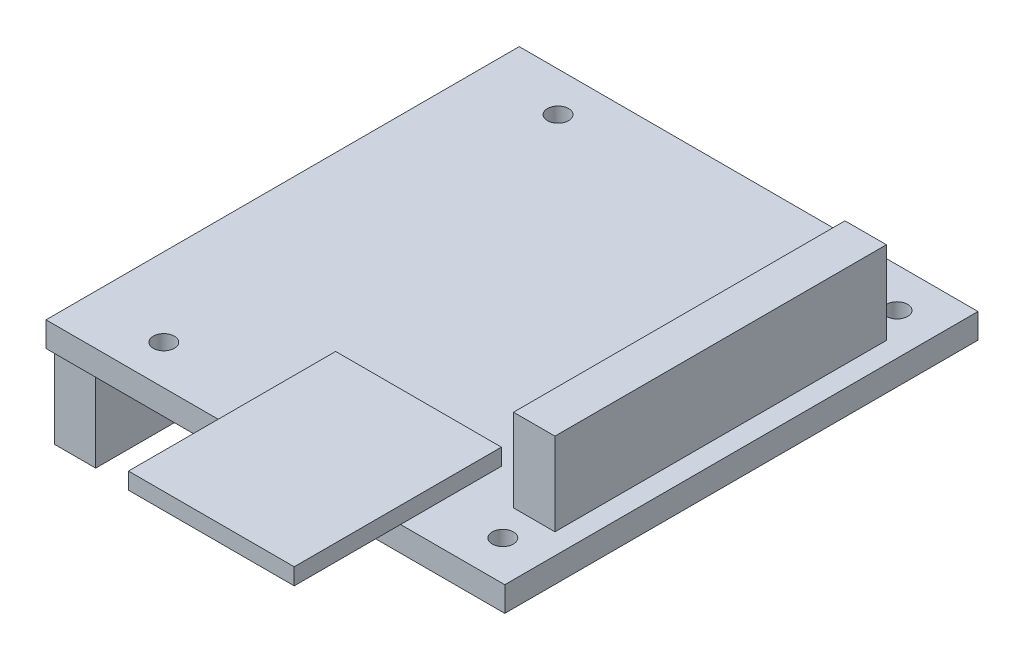
ISO-10303-21;
HEADER;
FILE_DESCRIPTION(('STEP AP214'),'2;1');
FILE_NAME('part.step','',(''),(''),'','','');
FILE_SCHEMA(('AUTOMOTIVE_DESIGN { 1 0 10303 214 1 1 1 1 }'));
ENDSEC;
DATA;
#1=APPLICATION_CONTEXT('core data for automotive mechanical design processes');
#2=APPLICATION_PROTOCOL_DEFINITION('international standard','automotive_design',2000,#1);
#3=PRODUCT_CONTEXT('',#1,'mechanical');
#4=PRODUCT('Part','Part','',(#3));
#5=PRODUCT_RELATED_PRODUCT_CATEGORY('part','',(#4));
#6=PRODUCT_DEFINITION_FORMATION('','',#4);
#7=PRODUCT_DEFINITION_CONTEXT('part definition',#1,'design');
#8=PRODUCT_DEFINITION('design','',#6,#7);
#9=PRODUCT_DEFINITION_SHAPE('','',#8);
#10=(LENGTH_UNIT() NAMED_UNIT(*) SI_UNIT(.MILLI.,.METRE.));
#11=(NAMED_UNIT(*) PLANE_ANGLE_UNIT() SI_UNIT($,.RADIAN.));
#12=(NAMED_UNIT(*) SI_UNIT($,.STERADIAN.) SOLID_ANGLE_UNIT());
#13=UNCERTAINTY_MEASURE_WITH_UNIT(LENGTH_MEASURE(1.E-05),#10,'distance_accuracy_value','');
#14=(GEOMETRIC_REPRESENTATION_CONTEXT(3) GLOBAL_UNCERTAINTY_ASSIGNED_CONTEXT((#13)) GLOBAL_UNIT_ASSIGNED_CONTEXT((#10,
#11,#12)) REPRESENTATION_CONTEXT('',''));
#15=CARTESIAN_POINT('',(0.,0.,0.));
#16=DIRECTION('',(0.,0.,1.));
#17=DIRECTION('',(1.,0.,0.));
#18=AXIS2_PLACEMENT_3D('',#15,#16,#17);
#19=CARTESIAN_POINT('',(0.,0.,-57.1));
#20=DIRECTION('',(0.,-1.,0.));
#21=DIRECTION('',(0.,0.,-1.));
#22=AXIS2_PLACEMENT_3D('',#19,#20,#21);
#23=PLANE('',#22);
#24=DIRECTION('',(1.,0.,0.));
#25=VECTOR('',#24,1.);
#26=CARTESIAN_POINT('',(0.5,0.,-56.6));
#27=LINE('',#26,#25);
#28=CARTESIAN_POINT('',(0.5,0.,-56.6));
#29=VERTEX_POINT('',#28);
#30=CARTESIAN_POINT('',(5.5,0.,-56.6));
#31=VERTEX_POINT('',#30);
#32=EDGE_CURVE('E210',#29,#31,#27,.T.);
#33=ORIENTED_EDGE('',*,*,#32,.F.);
#34=DIRECTION('',(0.,0.,-1.));
#35=VECTOR('',#34,1.);
#36=CARTESIAN_POINT('',(0.5,0.,-56.6));
#37=LINE('',#36,#35);
#38=CARTESIAN_POINT('',(0.5,0.,-0.5));
#39=VERTEX_POINT('',#38);
#40=EDGE_CURVE('E207',#39,#29,#37,.T.);
#41=ORIENTED_EDGE('',*,*,#40,.F.);
#42=DIRECTION('',(-1.,0.,0.));
#43=VECTOR('',#42,1.);
#44=CARTESIAN_POINT('',(0.5,0.,-0.5));
#45=LINE('',#44,#43);
#46=CARTESIAN_POINT('',(5.5,0.,-0.5));
#47=VERTEX_POINT('',#46);
#48=EDGE_CURVE('E220',#47,#39,#45,.T.);
#49=ORIENTED_EDGE('',*,*,#48,.F.);
#50=DIRECTION('',(0.,0.,1.));
#51=VECTOR('',#50,1.);
#52=CARTESIAN_POINT('',(5.5,0.,-56.6));
#53=LINE('',#52,#51);
#54=EDGE_CURVE('E228',#31,#47,#53,.T.);
#55=ORIENTED_EDGE('',*,*,#54,.F.);
#56=EDGE_LOOP('',(#33,#41,#49,#55));
#57=FACE_BOUND('',#56,.T.);
#58=CARTESIAN_POINT('',(9.45000000000002,0.,-4.765));
#59=DIRECTION('',(0.,1.,0.));
#60=DIRECTION('',(0.,0.,1.));
#61=AXIS2_PLACEMENT_3D('',#58,#59,#60);
#62=CIRCLE('',#61,1.275);
#63=CARTESIAN_POINT('',(9.45000000000002,0.,-3.49));
#64=VERTEX_POINT('',#63);
#65=EDGE_CURVE('E310',#64,#64,#62,.T.);
#66=ORIENTED_EDGE('',*,*,#65,.T.);
#67=EDGE_LOOP('',(#66));
#68=FACE_BOUND('',#67,.T.);
#69=CARTESIAN_POINT('',(9.45000000000002,0.,-52.335));
#70=DIRECTION('',(0.,1.,0.));
#71=DIRECTION('',(0.,0.,1.));
#72=AXIS2_PLACEMENT_3D('',#69,#70,#71);
#73=CIRCLE('',#72,1.275);
#74=CARTESIAN_POINT('',(9.45000000000002,0.,-51.06));
#75=VERTEX_POINT('',#74);
#76=EDGE_CURVE('E322',#75,#75,#73,.T.);
#77=ORIENTED_EDGE('',*,*,#76,.T.);
#78=EDGE_LOOP('',(#77));
#79=FACE_BOUND('',#78,.T.);
#80=CARTESIAN_POINT('',(50.36,0.,-52.335));
#81=DIRECTION('',(0.,1.,0.));
#82=DIRECTION('',(0.,0.,1.));
#83=AXIS2_PLACEMENT_3D('',#80,#81,#82);
#84=CIRCLE('',#83,1.275);
#85=CARTESIAN_POINT('',(50.36,0.,-51.06));
#86=VERTEX_POINT('',#85);
#87=EDGE_CURVE('E316',#86,#86,#84,.T.);
#88=ORIENTED_EDGE('',*,*,#87,.T.);
#89=EDGE_LOOP('',(#88));
#90=FACE_BOUND('',#89,.T.);
#91=CARTESIAN_POINT('',(50.36,0.,-4.765));
#92=DIRECTION('',(0.,1.,0.));
#93=DIRECTION('',(0.,0.,1.));
#94=AXIS2_PLACEMENT_3D('',#91,#92,#93);
#95=CIRCLE('',#94,1.275);
#96=CARTESIAN_POINT('',(50.36,0.,-3.49));
#97=VERTEX_POINT('',#96);
#98=EDGE_CURVE('E306',#97,#97,#95,.T.);
#99=ORIENTED_EDGE('',*,*,#98,.T.);
#100=EDGE_LOOP('',(#99));
#101=FACE_BOUND('',#100,.T.);
#102=DIRECTION('',(-1.,0.,0.));
#103=VECTOR('',#102,1.);
#104=CARTESIAN_POINT('',(22.2441503540784,0.,-54.9329702264743));
#105=LINE('',#104,#103);
#106=CARTESIAN_POINT('',(22.2441503540784,0.,-54.9329702264743));
#107=VERTEX_POINT('',#106);
#108=CARTESIAN_POINT('',(12.2441503540784,0.,-54.9329702264743));
#109=VERTEX_POINT('',#108);
#110=EDGE_CURVE('E439',#107,#109,#105,.T.);
#111=ORIENTED_EDGE('',*,*,#110,.F.);
#112=DIRECTION('',(0.,0.,1.));
#113=VECTOR('',#112,1.);
#114=CARTESIAN_POINT('',(22.2441503540784,0.,-54.9329702264743));
#115=LINE('',#114,#113);
#116=CARTESIAN_POINT('',(22.2441503540784,0.,-57.1));
#117=VERTEX_POINT('',#116);
#118=EDGE_CURVE('E206',#117,#107,#115,.T.);
#119=ORIENTED_EDGE('',*,*,#118,.F.);
#120=DIRECTION('',(-1.,0.,0.));
#121=VECTOR('',#120,1.);
#122=CARTESIAN_POINT('',(0.,0.,-57.1));
#123=LINE('',#122,#121);
#124=CARTESIAN_POINT('',(55.36,0.,-57.1));
#125=VERTEX_POINT('',#124);
#126=EDGE_CURVE('E335',#125,#117,#123,.T.);
#127=ORIENTED_EDGE('',*,*,#126,.F.);
#128=DIRECTION('',(0.,0.,-1.));
#129=VECTOR('',#128,1.);
#130=CARTESIAN_POINT('',(55.36,0.,0.));
#131=LINE('',#130,#129);
#132=CARTESIAN_POINT('',(55.36,0.,0.));
#133=VERTEX_POINT('',#132);
#134=EDGE_CURVE('E349',#133,#125,#131,.T.);
#135=ORIENTED_EDGE('',*,*,#134,.F.);
#136=DIRECTION('',(1.,0.,0.));
#137=VECTOR('',#136,1.);
#138=CARTESIAN_POINT('',(0.,0.,0.));
#139=LINE('',#138,#137);
#140=CARTESIAN_POINT('',(0.,0.,0.));
#141=VERTEX_POINT('',#140);
#142=EDGE_CURVE('E347',#141,#133,#139,.T.);
#143=ORIENTED_EDGE('',*,*,#142,.F.);
#144=DIRECTION('',(0.,0.,1.));
#145=VECTOR('',#144,1.);
#146=CARTESIAN_POINT('',(0.,0.,0.));
#147=LINE('',#146,#145);
#148=CARTESIAN_POINT('',(0.,0.,-57.1));
#149=VERTEX_POINT('',#148);
#150=EDGE_CURVE('E328',#149,#141,#147,.T.);
#151=ORIENTED_EDGE('',*,*,#150,.F.);
#152=CARTESIAN_POINT('',(12.2441503540784,0.,-57.1));
#153=VERTEX_POINT('',#152);
#154=EDGE_CURVE('E351',#153,#149,#123,.T.);
#155=ORIENTED_EDGE('',*,*,#154,.F.);
#156=DIRECTION('',(0.,0.,-1.));
#157=VECTOR('',#156,1.);
#158=CARTESIAN_POINT('',(12.2441503540784,0.,-54.9329702264743));
#159=LINE('',#158,#157);
#160=EDGE_CURVE('E46',#109,#153,#159,.T.);
#161=ORIENTED_EDGE('',*,*,#160,.F.);
#162=EDGE_LOOP('',(#111,#119,#127,#135,#143,#151,#155,#161));
#163=FACE_BOUND('',#162,.T.);
#164=ADVANCED_FACE('F31',(#57,#68,#79,#90,#101,#163),#23,.T.);
#165=CARTESIAN_POINT('',(0.,3.,-57.1));
#166=DIRECTION('',(0.,-1.,0.));
#167=DIRECTION('',(0.,0.,-1.));
#168=AXIS2_PLACEMENT_3D('',#165,#166,#167);
#169=PLANE('',#168);
#170=DIRECTION('',(0.,0.,1.));
#171=VECTOR('',#170,1.);
#172=CARTESIAN_POINT('',(47.86,3.,-48.55));
#173=LINE('',#172,#171);
#174=CARTESIAN_POINT('',(47.86,3.,-48.55));
#175=VERTEX_POINT('',#174);
#176=CARTESIAN_POINT('',(47.86,3.,-8.55));
#177=VERTEX_POINT('',#176);
#178=EDGE_CURVE('E273',#175,#177,#173,.T.);
#179=ORIENTED_EDGE('',*,*,#178,.F.);
#180=DIRECTION('',(-1.,0.,0.));
#181=VECTOR('',#180,1.);
#182=CARTESIAN_POINT('',(47.86,3.,-48.55));
#183=LINE('',#182,#181);
#184=CARTESIAN_POINT('',(52.86,3.,-48.55));
#185=VERTEX_POINT('',#184);
#186=EDGE_CURVE('E278',#185,#175,#183,.T.);
#187=ORIENTED_EDGE('',*,*,#186,.F.);
#188=DIRECTION('',(0.,0.,-1.));
#189=VECTOR('',#188,1.);
#190=CARTESIAN_POINT('',(52.86,3.,-48.55));
#191=LINE('',#190,#189);
#192=CARTESIAN_POINT('',(52.86,3.,-8.55));
#193=VERTEX_POINT('',#192);
#194=EDGE_CURVE('E290',#193,#185,#191,.T.);
#195=ORIENTED_EDGE('',*,*,#194,.F.);
#196=DIRECTION('',(1.,0.,0.));
#197=VECTOR('',#196,1.);
#198=CARTESIAN_POINT('',(47.86,3.,-8.55));
#199=LINE('',#198,#197);
#200=EDGE_CURVE('E287',#177,#193,#199,.T.);
#201=ORIENTED_EDGE('',*,*,#200,.F.);
#202=EDGE_LOOP('',(#179,#187,#195,#201));
#203=FACE_BOUND('',#202,.T.);
#204=CARTESIAN_POINT('',(9.45000000000002,3.,-4.765));
#205=DIRECTION('',(0.,1.,0.));
#206=DIRECTION('',(0.,0.,1.));
#207=AXIS2_PLACEMENT_3D('',#204,#205,#206);
#208=CIRCLE('',#207,1.275);
#209=CARTESIAN_POINT('',(9.45000000000002,3.,-3.49));
#210=VERTEX_POINT('',#209);
#211=EDGE_CURVE('E313',#210,#210,#208,.T.);
#212=ORIENTED_EDGE('',*,*,#211,.F.);
#213=EDGE_LOOP('',(#212));
#214=FACE_BOUND('',#213,.T.);
#215=CARTESIAN_POINT('',(9.45000000000002,3.,-52.335));
#216=DIRECTION('',(0.,1.,0.));
#217=DIRECTION('',(0.,0.,1.));
#218=AXIS2_PLACEMENT_3D('',#215,#216,#217);
#219=CIRCLE('',#218,1.275);
#220=CARTESIAN_POINT('',(9.45000000000002,3.,-51.06));
#221=VERTEX_POINT('',#220);
#222=EDGE_CURVE('E325',#221,#221,#219,.T.);
#223=ORIENTED_EDGE('',*,*,#222,.F.);
#224=EDGE_LOOP('',(#223));
#225=FACE_BOUND('',#224,.T.);
#226=CARTESIAN_POINT('',(50.36,3.,-52.335));
#227=DIRECTION('',(0.,1.,0.));
#228=DIRECTION('',(0.,0.,1.));
#229=AXIS2_PLACEMENT_3D('',#226,#227,#228);
#230=CIRCLE('',#229,1.275);
#231=CARTESIAN_POINT('',(50.36,3.,-51.06));
#232=VERTEX_POINT('',#231);
#233=EDGE_CURVE('E319',#232,#232,#230,.T.);
#234=ORIENTED_EDGE('',*,*,#233,.F.);
#235=EDGE_LOOP('',(#234));
#236=FACE_BOUND('',#235,.T.);
#237=CARTESIAN_POINT('',(50.36,3.,-4.765));
#238=DIRECTION('',(0.,1.,0.));
#239=DIRECTION('',(0.,0.,1.));
#240=AXIS2_PLACEMENT_3D('',#237,#238,#239);
#241=CIRCLE('',#240,1.275);
#242=CARTESIAN_POINT('',(50.36,3.,-3.49));
#243=VERTEX_POINT('',#242);
#244=EDGE_CURVE('E307',#243,#243,#241,.T.);
#245=ORIENTED_EDGE('',*,*,#244,.F.);
#246=EDGE_LOOP('',(#245));
#247=FACE_BOUND('',#246,.T.);
#248=DIRECTION('',(0.,0.,-1.));
#249=VECTOR('',#248,1.);
#250=CARTESIAN_POINT('',(42.7802768204413,3.,-12.1695950704833));
#251=LINE('',#250,#249);
#252=CARTESIAN_POINT('',(42.7802768204413,3.,0.));
#253=VERTEX_POINT('',#252);
#254=CARTESIAN_POINT('',(42.7802768204413,3.,-12.1695950704833));
#255=VERTEX_POINT('',#254);
#256=EDGE_CURVE('E239',#253,#255,#251,.T.);
#257=ORIENTED_EDGE('',*,*,#256,.F.);
#258=DIRECTION('',(1.,0.,0.));
#259=VECTOR('',#258,1.);
#260=CARTESIAN_POINT('',(0.,3.,0.));
#261=LINE('',#260,#259);
#262=CARTESIAN_POINT('',(55.36,3.,0.));
#263=VERTEX_POINT('',#262);
#264=EDGE_CURVE('E334',#253,#263,#261,.T.);
#265=ORIENTED_EDGE('',*,*,#264,.T.);
#266=DIRECTION('',(0.,0.,-1.));
#267=VECTOR('',#266,1.);
#268=CARTESIAN_POINT('',(55.36,3.,0.));
#269=LINE('',#268,#267);
#270=CARTESIAN_POINT('',(55.36,3.,-57.1));
#271=VERTEX_POINT('',#270);
#272=EDGE_CURVE('E339',#263,#271,#269,.T.);
#273=ORIENTED_EDGE('',*,*,#272,.T.);
#274=DIRECTION('',(-1.,0.,0.));
#275=VECTOR('',#274,1.);
#276=CARTESIAN_POINT('',(0.,3.,-57.1));
#277=LINE('',#276,#275);
#278=CARTESIAN_POINT('',(0.,3.,-57.1));
#279=VERTEX_POINT('',#278);
#280=EDGE_CURVE('E342',#271,#279,#277,.T.);
#281=ORIENTED_EDGE('',*,*,#280,.T.);
#282=DIRECTION('',(0.,0.,1.));
#283=VECTOR('',#282,1.);
#284=CARTESIAN_POINT('',(0.,3.,0.));
#285=LINE('',#284,#283);
#286=CARTESIAN_POINT('',(0.,3.,0.));
#287=VERTEX_POINT('',#286);
#288=EDGE_CURVE('E331',#279,#287,#285,.T.);
#289=ORIENTED_EDGE('',*,*,#288,.T.);
#290=CARTESIAN_POINT('',(22.7802768204413,3.,0.));
#291=VERTEX_POINT('',#290);
#292=EDGE_CURVE('E336',#287,#291,#261,.T.);
#293=ORIENTED_EDGE('',*,*,#292,.T.);
#294=DIRECTION('',(0.,0.,1.));
#295=VECTOR('',#294,1.);
#296=CARTESIAN_POINT('',(22.7802768204413,3.,-12.1695950704833));
#297=LINE('',#296,#295);
#298=CARTESIAN_POINT('',(22.7802768204413,3.,-12.1695950704833));
#299=VERTEX_POINT('',#298);
#300=EDGE_CURVE('E258',#299,#291,#297,.T.);
#301=ORIENTED_EDGE('',*,*,#300,.F.);
#302=DIRECTION('',(-1.,0.,0.));
#303=VECTOR('',#302,1.);
#304=CARTESIAN_POINT('',(42.7802768204413,3.,-12.1695950704833));
#305=LINE('',#304,#303);
#306=EDGE_CURVE('E254',#255,#299,#305,.T.);
#307=ORIENTED_EDGE('',*,*,#306,.F.);
#308=EDGE_LOOP('',(#257,#265,#273,#281,#289,#293,#301,#307));
#309=FACE_BOUND('',#308,.T.);
#310=ADVANCED_FACE('F378',(#203,#214,#225,#236,#247,#309),#169,.F.);
#311=CARTESIAN_POINT('',(0.,3.,0.));
#312=DIRECTION('',(1.,0.,0.));
#313=DIRECTION('',(0.,0.,-1.));
#314=AXIS2_PLACEMENT_3D('',#311,#312,#313);
#315=PLANE('',#314);
#316=ORIENTED_EDGE('',*,*,#150,.T.);
#317=DIRECTION('',(0.,-1.,0.));
#318=VECTOR('',#317,1.);
#319=CARTESIAN_POINT('',(0.,3.,0.));
#320=LINE('',#319,#318);
#321=EDGE_CURVE('E11',#287,#141,#320,.T.);
#322=ORIENTED_EDGE('',*,*,#321,.F.);
#323=ORIENTED_EDGE('',*,*,#288,.F.);
#324=DIRECTION('',(0.,-1.,0.));
#325=VECTOR('',#324,1.);
#326=CARTESIAN_POINT('',(0.,3.,-57.1));
#327=LINE('',#326,#325);
#328=EDGE_CURVE('E344',#279,#149,#327,.T.);
#329=ORIENTED_EDGE('',*,*,#328,.T.);
#330=EDGE_LOOP('',(#316,#322,#323,#329));
#331=FACE_BOUND('',#330,.T.);
#332=ADVANCED_FACE('F33',(#331),#315,.F.);
#333=CARTESIAN_POINT('',(0.,3.,0.));
#334=DIRECTION('',(0.,0.,-1.));
#335=DIRECTION('',(-1.,0.,0.));
#336=AXIS2_PLACEMENT_3D('',#333,#334,#335);
#337=PLANE('',#336);
#338=ORIENTED_EDGE('',*,*,#142,.T.);
#339=DIRECTION('',(0.,-1.,0.));
#340=VECTOR('',#339,1.);
#341=CARTESIAN_POINT('',(55.36,3.,0.));
#342=LINE('',#341,#340);
#343=EDGE_CURVE('E39',#263,#133,#342,.T.);
#344=ORIENTED_EDGE('',*,*,#343,.F.);
#345=ORIENTED_EDGE('',*,*,#264,.F.);
#346=EDGE_CURVE('E340',#291,#253,#261,.T.);
#347=ORIENTED_EDGE('',*,*,#346,.F.);
#348=ORIENTED_EDGE('',*,*,#292,.F.);
#349=ORIENTED_EDGE('',*,*,#321,.T.);
#350=EDGE_LOOP('',(#338,#344,#345,#347,#348,#349));
#351=FACE_BOUND('',#350,.T.);
#352=ADVANCED_FACE('F432',(#351),#337,.F.);
#353=CARTESIAN_POINT('',(55.36,3.,0.));
#354=DIRECTION('',(-1.,0.,0.));
#355=DIRECTION('',(0.,0.,1.));
#356=AXIS2_PLACEMENT_3D('',#353,#354,#355);
#357=PLANE('',#356);
#358=ORIENTED_EDGE('',*,*,#134,.T.);
#359=DIRECTION('',(0.,-1.,0.));
#360=VECTOR('',#359,1.);
#361=CARTESIAN_POINT('',(55.36,3.,-57.1));
#362=LINE('',#361,#360);
#363=EDGE_CURVE('E357',#271,#125,#362,.T.);
#364=ORIENTED_EDGE('',*,*,#363,.F.);
#365=ORIENTED_EDGE('',*,*,#272,.F.);
#366=ORIENTED_EDGE('',*,*,#343,.T.);
#367=EDGE_LOOP('',(#358,#364,#365,#366));
#368=FACE_BOUND('',#367,.T.);
#369=ADVANCED_FACE('F364',(#368),#357,.F.);
#370=CARTESIAN_POINT('',(0.,3.,-57.1));
#371=DIRECTION('',(0.,0.,1.));
#372=DIRECTION('',(1.,0.,0.));
#373=AXIS2_PLACEMENT_3D('',#370,#371,#372);
#374=PLANE('',#373);
#375=ORIENTED_EDGE('',*,*,#126,.T.);
#376=EDGE_CURVE('E354',#117,#153,#123,.T.);
#377=ORIENTED_EDGE('',*,*,#376,.T.);
#378=ORIENTED_EDGE('',*,*,#154,.T.);
#379=ORIENTED_EDGE('',*,*,#328,.F.);
#380=ORIENTED_EDGE('',*,*,#280,.F.);
#381=ORIENTED_EDGE('',*,*,#363,.T.);
#382=EDGE_LOOP('',(#375,#377,#378,#379,#380,#381));
#383=FACE_BOUND('',#382,.T.);
#384=ADVANCED_FACE('F372',(#383),#374,.F.);
#385=CARTESIAN_POINT('',(9.45000000000002,3.,-52.335));
#386=DIRECTION('',(0.,-1.,0.));
#387=DIRECTION('',(0.,0.,-1.));
#388=AXIS2_PLACEMENT_3D('',#385,#386,#387);
#389=CYLINDRICAL_SURFACE('',#388,1.275);
#390=ORIENTED_EDGE('',*,*,#222,.T.);
#391=EDGE_LOOP('',(#390));
#392=FACE_BOUND('',#391,.T.);
#393=ORIENTED_EDGE('',*,*,#76,.F.);
#394=EDGE_LOOP('',(#393));
#395=FACE_BOUND('',#394,.T.);
#396=ADVANCED_FACE('F430',(#392,#395),#389,.F.);
#397=CARTESIAN_POINT('',(50.36,3.,-52.335));
#398=DIRECTION('',(0.,-1.,0.));
#399=DIRECTION('',(0.,0.,-1.));
#400=AXIS2_PLACEMENT_3D('',#397,#398,#399);
#401=CYLINDRICAL_SURFACE('',#400,1.275);
#402=ORIENTED_EDGE('',*,*,#233,.T.);
#403=EDGE_LOOP('',(#402));
#404=FACE_BOUND('',#403,.T.);
#405=ORIENTED_EDGE('',*,*,#87,.F.);
#406=EDGE_LOOP('',(#405));
#407=FACE_BOUND('',#406,.T.);
#408=ADVANCED_FACE('F666',(#404,#407),#401,.F.);
#409=CARTESIAN_POINT('',(9.45000000000002,3.,-4.765));
#410=DIRECTION('',(0.,-1.,0.));
#411=DIRECTION('',(0.,0.,-1.));
#412=AXIS2_PLACEMENT_3D('',#409,#410,#411);
#413=CYLINDRICAL_SURFACE('',#412,1.275);
#414=ORIENTED_EDGE('',*,*,#211,.T.);
#415=EDGE_LOOP('',(#414));
#416=FACE_BOUND('',#415,.T.);
#417=ORIENTED_EDGE('',*,*,#65,.F.);
#418=EDGE_LOOP('',(#417));
#419=FACE_BOUND('',#418,.T.);
#420=ADVANCED_FACE('F657',(#416,#419),#413,.F.);
#421=CARTESIAN_POINT('',(50.36,3.,-4.765));
#422=DIRECTION('',(0.,-1.,0.));
#423=DIRECTION('',(0.,0.,-1.));
#424=AXIS2_PLACEMENT_3D('',#421,#422,#423);
#425=CYLINDRICAL_SURFACE('',#424,1.275);
#426=ORIENTED_EDGE('',*,*,#244,.T.);
#427=EDGE_LOOP('',(#426));
#428=FACE_BOUND('',#427,.T.);
#429=ORIENTED_EDGE('',*,*,#98,.F.);
#430=EDGE_LOOP('',(#429));
#431=FACE_BOUND('',#430,.T.);
#432=ADVANCED_FACE('F648',(#428,#431),#425,.F.);
#433=CARTESIAN_POINT('',(47.86,13.,-48.55));
#434=DIRECTION('',(1.,0.,0.));
#435=DIRECTION('',(0.,0.,-1.));
#436=AXIS2_PLACEMENT_3D('',#433,#434,#435);
#437=PLANE('',#436);
#438=ORIENTED_EDGE('',*,*,#178,.T.);
#439=DIRECTION('',(0.,-1.,0.));
#440=VECTOR('',#439,1.);
#441=CARTESIAN_POINT('',(47.86,13.,-8.55));
#442=LINE('',#441,#440);
#443=CARTESIAN_POINT('',(47.86,13.,-8.55));
#444=VERTEX_POINT('',#443);
#445=EDGE_CURVE('E303',#444,#177,#442,.T.);
#446=ORIENTED_EDGE('',*,*,#445,.F.);
#447=DIRECTION('',(0.,0.,1.));
#448=VECTOR('',#447,1.);
#449=CARTESIAN_POINT('',(47.86,13.,-48.55));
#450=LINE('',#449,#448);
#451=CARTESIAN_POINT('',(47.86,13.,-48.55));
#452=VERTEX_POINT('',#451);
#453=EDGE_CURVE('E274',#452,#444,#450,.T.);
#454=ORIENTED_EDGE('',*,*,#453,.F.);
#455=DIRECTION('',(0.,-1.,0.));
#456=VECTOR('',#455,1.);
#457=CARTESIAN_POINT('',(47.86,13.,-48.55));
#458=LINE('',#457,#456);
#459=EDGE_CURVE('E284',#452,#175,#458,.T.);
#460=ORIENTED_EDGE('',*,*,#459,.T.);
#461=EDGE_LOOP('',(#438,#446,#454,#460));
#462=FACE_BOUND('',#461,.T.);
#463=ADVANCED_FACE('F639',(#462),#437,.F.);
#464=CARTESIAN_POINT('',(47.86,13.,-8.55));
#465=DIRECTION('',(0.,0.,-1.));
#466=DIRECTION('',(-1.,0.,0.));
#467=AXIS2_PLACEMENT_3D('',#464,#465,#466);
#468=PLANE('',#467);
#469=ORIENTED_EDGE('',*,*,#200,.T.);
#470=DIRECTION('',(0.,-1.,0.));
#471=VECTOR('',#470,1.);
#472=CARTESIAN_POINT('',(52.86,13.,-8.55));
#473=LINE('',#472,#471);
#474=CARTESIAN_POINT('',(52.86,13.,-8.55));
#475=VERTEX_POINT('',#474);
#476=EDGE_CURVE('E300',#475,#193,#473,.T.);
#477=ORIENTED_EDGE('',*,*,#476,.F.);
#478=DIRECTION('',(1.,0.,0.));
#479=VECTOR('',#478,1.);
#480=CARTESIAN_POINT('',(47.86,13.,-8.55));
#481=LINE('',#480,#479);
#482=EDGE_CURVE('E277',#444,#475,#481,.T.);
#483=ORIENTED_EDGE('',*,*,#482,.F.);
#484=ORIENTED_EDGE('',*,*,#445,.T.);
#485=EDGE_LOOP('',(#469,#477,#483,#484));
#486=FACE_BOUND('',#485,.T.);
#487=ADVANCED_FACE('F630',(#486),#468,.F.);
#488=CARTESIAN_POINT('',(52.86,13.,-48.55));
#489=DIRECTION('',(-1.,0.,0.));
#490=DIRECTION('',(0.,0.,1.));
#491=AXIS2_PLACEMENT_3D('',#488,#489,#490);
#492=PLANE('',#491);
#493=ORIENTED_EDGE('',*,*,#194,.T.);
#494=DIRECTION('',(0.,-1.,0.));
#495=VECTOR('',#494,1.);
#496=CARTESIAN_POINT('',(52.86,13.,-48.55));
#497=LINE('',#496,#495);
#498=CARTESIAN_POINT('',(52.86,13.,-48.55));
#499=VERTEX_POINT('',#498);
#500=EDGE_CURVE('E297',#499,#185,#497,.T.);
#501=ORIENTED_EDGE('',*,*,#500,.F.);
#502=DIRECTION('',(0.,0.,-1.));
#503=VECTOR('',#502,1.);
#504=CARTESIAN_POINT('',(52.86,13.,-48.55));
#505=LINE('',#504,#503);
#506=EDGE_CURVE('E280',#475,#499,#505,.T.);
#507=ORIENTED_EDGE('',*,*,#506,.F.);
#508=ORIENTED_EDGE('',*,*,#476,.T.);
#509=EDGE_LOOP('',(#493,#501,#507,#508));
#510=FACE_BOUND('',#509,.T.);
#511=ADVANCED_FACE('F621',(#510),#492,.F.);
#512=CARTESIAN_POINT('',(47.86,13.,-48.55));
#513=DIRECTION('',(0.,0.,1.));
#514=DIRECTION('',(1.,0.,0.));
#515=AXIS2_PLACEMENT_3D('',#512,#513,#514);
#516=PLANE('',#515);
#517=ORIENTED_EDGE('',*,*,#186,.T.);
#518=ORIENTED_EDGE('',*,*,#459,.F.);
#519=DIRECTION('',(-1.,0.,0.));
#520=VECTOR('',#519,1.);
#521=CARTESIAN_POINT('',(47.86,13.,-48.55));
#522=LINE('',#521,#520);
#523=EDGE_CURVE('E282',#499,#452,#522,.T.);
#524=ORIENTED_EDGE('',*,*,#523,.F.);
#525=ORIENTED_EDGE('',*,*,#500,.T.);
#526=EDGE_LOOP('',(#517,#518,#524,#525));
#527=FACE_BOUND('',#526,.T.);
#528=ADVANCED_FACE('F612',(#527),#516,.F.);
#529=CARTESIAN_POINT('',(47.86,13.,-8.55));
#530=DIRECTION('',(0.,1.,0.));
#531=DIRECTION('',(0.,0.,1.));
#532=AXIS2_PLACEMENT_3D('',#529,#530,#531);
#533=PLANE('',#532);
#534=ORIENTED_EDGE('',*,*,#453,.T.);
#535=ORIENTED_EDGE('',*,*,#482,.T.);
#536=ORIENTED_EDGE('',*,*,#506,.T.);
#537=ORIENTED_EDGE('',*,*,#523,.T.);
#538=EDGE_LOOP('',(#534,#535,#536,#537));
#539=FACE_BOUND('',#538,.T.);
#540=ADVANCED_FACE('F600',(#539),#533,.T.);
#541=CARTESIAN_POINT('',(42.7802768204413,3.,12.8304049295167));
#542=DIRECTION('',(0.,-1.,0.));
#543=DIRECTION('',(0.,0.,-1.));
#544=AXIS2_PLACEMENT_3D('',#541,#542,#543);
#545=PLANE('',#544);
#546=ORIENTED_EDGE('',*,*,#346,.T.);
#547=CARTESIAN_POINT('',(42.7802768204413,3.,12.8304049295167));
#548=VERTEX_POINT('',#547);
#549=EDGE_CURVE('E251',#548,#253,#251,.T.);
#550=ORIENTED_EDGE('',*,*,#549,.F.);
#551=DIRECTION('',(1.,0.,0.));
#552=VECTOR('',#551,1.);
#553=CARTESIAN_POINT('',(42.7802768204413,3.,12.8304049295167));
#554=LINE('',#553,#552);
#555=CARTESIAN_POINT('',(22.7802768204413,3.,12.8304049295167));
#556=VERTEX_POINT('',#555);
#557=EDGE_CURVE('E244',#556,#548,#554,.T.);
#558=ORIENTED_EDGE('',*,*,#557,.F.);
#559=EDGE_CURVE('E257',#291,#556,#297,.T.);
#560=ORIENTED_EDGE('',*,*,#559,.F.);
#561=EDGE_LOOP('',(#546,#550,#558,#560));
#562=FACE_BOUND('',#561,.T.);
#563=ADVANCED_FACE('F385',(#562),#545,.T.);
#564=CARTESIAN_POINT('',(42.7802768204413,5.,-12.1695950704833));
#565=DIRECTION('',(-1.,0.,0.));
#566=DIRECTION('',(0.,0.,1.));
#567=AXIS2_PLACEMENT_3D('',#564,#565,#566);
#568=PLANE('',#567);
#569=ORIENTED_EDGE('',*,*,#549,.T.);
#570=ORIENTED_EDGE('',*,*,#256,.T.);
#571=DIRECTION('',(0.,-1.,0.));
#572=VECTOR('',#571,1.);
#573=CARTESIAN_POINT('',(42.7802768204413,5.,-12.1695950704833));
#574=LINE('',#573,#572);
#575=CARTESIAN_POINT('',(42.7802768204413,5.,-12.1695950704833));
#576=VERTEX_POINT('',#575);
#577=EDGE_CURVE('E270',#576,#255,#574,.T.);
#578=ORIENTED_EDGE('',*,*,#577,.F.);
#579=DIRECTION('',(0.,0.,-1.));
#580=VECTOR('',#579,1.);
#581=CARTESIAN_POINT('',(42.7802768204413,5.,-12.1695950704833));
#582=LINE('',#581,#580);
#583=CARTESIAN_POINT('',(42.7802768204413,5.,12.8304049295167));
#584=VERTEX_POINT('',#583);
#585=EDGE_CURVE('E240',#584,#576,#582,.T.);
#586=ORIENTED_EDGE('',*,*,#585,.F.);
#587=DIRECTION('',(0.,-1.,0.));
#588=VECTOR('',#587,1.);
#589=CARTESIAN_POINT('',(42.7802768204413,5.,12.8304049295167));
#590=LINE('',#589,#588);
#591=EDGE_CURVE('E250',#584,#548,#590,.T.);
#592=ORIENTED_EDGE('',*,*,#591,.T.);
#593=EDGE_LOOP('',(#569,#570,#578,#586,#592));
#594=FACE_BOUND('',#593,.T.);
#595=ADVANCED_FACE('F388',(#594),#568,.F.);
#596=CARTESIAN_POINT('',(42.7802768204413,5.,-12.1695950704833));
#597=DIRECTION('',(0.,0.,1.));
#598=DIRECTION('',(1.,0.,0.));
#599=AXIS2_PLACEMENT_3D('',#596,#597,#598);
#600=PLANE('',#599);
#601=ORIENTED_EDGE('',*,*,#306,.T.);
#602=DIRECTION('',(0.,-1.,0.));
#603=VECTOR('',#602,1.);
#604=CARTESIAN_POINT('',(22.7802768204413,5.,-12.1695950704833));
#605=LINE('',#604,#603);
#606=CARTESIAN_POINT('',(22.7802768204413,5.,-12.1695950704833));
#607=VERTEX_POINT('',#606);
#608=EDGE_CURVE('E267',#607,#299,#605,.T.);
#609=ORIENTED_EDGE('',*,*,#608,.F.);
#610=DIRECTION('',(-1.,0.,0.));
#611=VECTOR('',#610,1.);
#612=CARTESIAN_POINT('',(42.7802768204413,5.,-12.1695950704833));
#613=LINE('',#612,#611);
#614=EDGE_CURVE('E243',#576,#607,#613,.T.);
#615=ORIENTED_EDGE('',*,*,#614,.F.);
#616=ORIENTED_EDGE('',*,*,#577,.T.);
#617=EDGE_LOOP('',(#601,#609,#615,#616));
#618=FACE_BOUND('',#617,.T.);
#619=ADVANCED_FACE('F401',(#618),#600,.F.);
#620=CARTESIAN_POINT('',(22.7802768204413,5.,-12.1695950704833));
#621=DIRECTION('',(1.,0.,0.));
#622=DIRECTION('',(0.,0.,-1.));
#623=AXIS2_PLACEMENT_3D('',#620,#621,#622);
#624=PLANE('',#623);
#625=ORIENTED_EDGE('',*,*,#300,.T.);
#626=ORIENTED_EDGE('',*,*,#559,.T.);
#627=DIRECTION('',(0.,-1.,0.));
#628=VECTOR('',#627,1.);
#629=CARTESIAN_POINT('',(22.7802768204413,5.,12.8304049295167));
#630=LINE('',#629,#628);
#631=CARTESIAN_POINT('',(22.7802768204413,5.,12.8304049295167));
#632=VERTEX_POINT('',#631);
#633=EDGE_CURVE('E264',#632,#556,#630,.T.);
#634=ORIENTED_EDGE('',*,*,#633,.F.);
#635=DIRECTION('',(0.,0.,1.));
#636=VECTOR('',#635,1.);
#637=CARTESIAN_POINT('',(22.7802768204413,5.,-12.1695950704833));
#638=LINE('',#637,#636);
#639=EDGE_CURVE('E246',#607,#632,#638,.T.);
#640=ORIENTED_EDGE('',*,*,#639,.F.);
#641=ORIENTED_EDGE('',*,*,#608,.T.);
#642=EDGE_LOOP('',(#625,#626,#634,#640,#641));
#643=FACE_BOUND('',#642,.T.);
#644=ADVANCED_FACE('F398',(#643),#624,.F.);
#645=CARTESIAN_POINT('',(42.7802768204413,5.,12.8304049295167));
#646=DIRECTION('',(0.,0.,-1.));
#647=DIRECTION('',(-1.,0.,0.));
#648=AXIS2_PLACEMENT_3D('',#645,#646,#647);
#649=PLANE('',#648);
#650=ORIENTED_EDGE('',*,*,#557,.T.);
#651=ORIENTED_EDGE('',*,*,#591,.F.);
#652=DIRECTION('',(1.,0.,0.));
#653=VECTOR('',#652,1.);
#654=CARTESIAN_POINT('',(42.7802768204413,5.,12.8304049295167));
#655=LINE('',#654,#653);
#656=EDGE_CURVE('E248',#632,#584,#655,.T.);
#657=ORIENTED_EDGE('',*,*,#656,.F.);
#658=ORIENTED_EDGE('',*,*,#633,.T.);
#659=EDGE_LOOP('',(#650,#651,#657,#658));
#660=FACE_BOUND('',#659,.T.);
#661=ADVANCED_FACE('F394',(#660),#649,.F.);
#662=CARTESIAN_POINT('',(42.7802768204413,5.,12.8304049295167));
#663=DIRECTION('',(0.,-1.,0.));
#664=DIRECTION('',(0.,0.,-1.));
#665=AXIS2_PLACEMENT_3D('',#662,#663,#664);
#666=PLANE('',#665);
#667=ORIENTED_EDGE('',*,*,#585,.T.);
#668=ORIENTED_EDGE('',*,*,#614,.T.);
#669=ORIENTED_EDGE('',*,*,#639,.T.);
#670=ORIENTED_EDGE('',*,*,#656,.T.);
#671=EDGE_LOOP('',(#667,#668,#669,#670));
#672=FACE_BOUND('',#671,.T.);
#673=ADVANCED_FACE('F403',(#672),#666,.F.);
#674=CARTESIAN_POINT('',(0.5,-10.,-56.6));
#675=DIRECTION('',(1.,0.,0.));
#676=DIRECTION('',(0.,0.,-1.));
#677=AXIS2_PLACEMENT_3D('',#674,#675,#676);
#678=PLANE('',#677);
#679=ORIENTED_EDGE('',*,*,#40,.T.);
#680=DIRECTION('',(0.,1.,0.));
#681=VECTOR('',#680,1.);
#682=CARTESIAN_POINT('',(0.5,-10.,-56.6));
#683=LINE('',#682,#681);
#684=CARTESIAN_POINT('',(0.5,-10.,-56.6));
#685=VERTEX_POINT('',#684);
#686=EDGE_CURVE('E237',#685,#29,#683,.T.);
#687=ORIENTED_EDGE('',*,*,#686,.F.);
#688=DIRECTION('',(0.,0.,-1.));
#689=VECTOR('',#688,1.);
#690=CARTESIAN_POINT('',(0.5,-10.,-56.6));
#691=LINE('',#690,#689);
#692=CARTESIAN_POINT('',(0.5,-10.,-0.5));
#693=VERTEX_POINT('',#692);
#694=EDGE_CURVE('E216',#693,#685,#691,.T.);
#695=ORIENTED_EDGE('',*,*,#694,.F.);
#696=DIRECTION('',(0.,1.,0.));
#697=VECTOR('',#696,1.);
#698=CARTESIAN_POINT('',(0.5,-10.,-0.5));
#699=LINE('',#698,#697);
#700=EDGE_CURVE('E225',#693,#39,#699,.T.);
#701=ORIENTED_EDGE('',*,*,#700,.T.);
#702=EDGE_LOOP('',(#679,#687,#695,#701));
#703=FACE_BOUND('',#702,.T.);
#704=ADVANCED_FACE('F405',(#703),#678,.F.);
#705=CARTESIAN_POINT('',(0.5,-10.,-56.6));
#706=DIRECTION('',(0.,0.,1.));
#707=DIRECTION('',(1.,0.,0.));
#708=AXIS2_PLACEMENT_3D('',#705,#706,#707);
#709=PLANE('',#708);
#710=ORIENTED_EDGE('',*,*,#32,.T.);
#711=DIRECTION('',(0.,1.,0.));
#712=VECTOR('',#711,1.);
#713=CARTESIAN_POINT('',(5.5,-10.,-56.6));
#714=LINE('',#713,#712);
#715=CARTESIAN_POINT('',(5.5,-10.,-56.6));
#716=VERTEX_POINT('',#715);
#717=EDGE_CURVE('E234',#716,#31,#714,.T.);
#718=ORIENTED_EDGE('',*,*,#717,.F.);
#719=DIRECTION('',(1.,0.,0.));
#720=VECTOR('',#719,1.);
#721=CARTESIAN_POINT('',(0.5,-10.,-56.6));
#722=LINE('',#721,#720);
#723=EDGE_CURVE('E219',#685,#716,#722,.T.);
#724=ORIENTED_EDGE('',*,*,#723,.F.);
#725=ORIENTED_EDGE('',*,*,#686,.T.);
#726=EDGE_LOOP('',(#710,#718,#724,#725));
#727=FACE_BOUND('',#726,.T.);
#728=ADVANCED_FACE('F411',(#727),#709,.F.);
#729=CARTESIAN_POINT('',(5.5,-10.,-56.6));
#730=DIRECTION('',(-1.,0.,0.));
#731=DIRECTION('',(0.,0.,1.));
#732=AXIS2_PLACEMENT_3D('',#729,#730,#731);
#733=PLANE('',#732);
#734=ORIENTED_EDGE('',*,*,#54,.T.);
#735=DIRECTION('',(0.,1.,0.));
#736=VECTOR('',#735,1.);
#737=CARTESIAN_POINT('',(5.5,-10.,-0.5));
#738=LINE('',#737,#736);
#739=CARTESIAN_POINT('',(5.5,-10.,-0.5));
#740=VERTEX_POINT('',#739);
#741=EDGE_CURVE('E54',#740,#47,#738,.T.);
#742=ORIENTED_EDGE('',*,*,#741,.F.);
#743=DIRECTION('',(0.,0.,1.));
#744=VECTOR('',#743,1.);
#745=CARTESIAN_POINT('',(5.5,-10.,-56.6));
#746=LINE('',#745,#744);
#747=EDGE_CURVE('E222',#716,#740,#746,.T.);
#748=ORIENTED_EDGE('',*,*,#747,.F.);
#749=ORIENTED_EDGE('',*,*,#717,.T.);
#750=EDGE_LOOP('',(#734,#742,#748,#749));
#751=FACE_BOUND('',#750,.T.);
#752=ADVANCED_FACE('F478',(#751),#733,.F.);
#753=CARTESIAN_POINT('',(0.5,-10.,-0.5));
#754=DIRECTION('',(0.,0.,-1.));
#755=DIRECTION('',(-1.,0.,0.));
#756=AXIS2_PLACEMENT_3D('',#753,#754,#755);
#757=PLANE('',#756);
#758=ORIENTED_EDGE('',*,*,#48,.T.);
#759=ORIENTED_EDGE('',*,*,#700,.F.);
#760=DIRECTION('',(-1.,0.,0.));
#761=VECTOR('',#760,1.);
#762=CARTESIAN_POINT('',(0.5,-10.,-0.5));
#763=LINE('',#762,#761);
#764=EDGE_CURVE('E224',#740,#693,#763,.T.);
#765=ORIENTED_EDGE('',*,*,#764,.F.);
#766=ORIENTED_EDGE('',*,*,#741,.T.);
#767=EDGE_LOOP('',(#758,#759,#765,#766));
#768=FACE_BOUND('',#767,.T.);
#769=ADVANCED_FACE('F474',(#768),#757,.F.);
#770=CARTESIAN_POINT('',(0.5,-10.,-0.5));
#771=DIRECTION('',(0.,1.,0.));
#772=DIRECTION('',(0.,0.,1.));
#773=AXIS2_PLACEMENT_3D('',#770,#771,#772);
#774=PLANE('',#773);
#775=ORIENTED_EDGE('',*,*,#694,.T.);
#776=ORIENTED_EDGE('',*,*,#723,.T.);
#777=ORIENTED_EDGE('',*,*,#747,.T.);
#778=ORIENTED_EDGE('',*,*,#764,.T.);
#779=EDGE_LOOP('',(#775,#776,#777,#778));
#780=FACE_BOUND('',#779,.T.);
#781=ADVANCED_FACE('F471',(#780),#774,.F.);
#782=CARTESIAN_POINT('',(22.2441503540784,0.,-59.9329702264743));
#783=DIRECTION('',(0.,1.,0.));
#784=DIRECTION('',(0.,0.,1.));
#785=AXIS2_PLACEMENT_3D('',#782,#783,#784);
#786=PLANE('',#785);
#787=ORIENTED_EDGE('',*,*,#376,.F.);
#788=CARTESIAN_POINT('',(22.2441503540784,0.,-59.9329702264743));
#789=VERTEX_POINT('',#788);
#790=EDGE_CURVE('E455',#789,#117,#115,.T.);
#791=ORIENTED_EDGE('',*,*,#790,.F.);
#792=DIRECTION('',(1.,0.,0.));
#793=VECTOR('',#792,1.);
#794=CARTESIAN_POINT('',(22.2441503540784,0.,-59.9329702264743));
#795=LINE('',#794,#793);
#796=CARTESIAN_POINT('',(12.2441503540784,0.,-59.9329702264743));
#797=VERTEX_POINT('',#796);
#798=EDGE_CURVE('E201',#797,#789,#795,.T.);
#799=ORIENTED_EDGE('',*,*,#798,.F.);
#800=EDGE_CURVE('E440',#153,#797,#159,.T.);
#801=ORIENTED_EDGE('',*,*,#800,.F.);
#802=EDGE_LOOP('',(#787,#791,#799,#801));
#803=FACE_BOUND('',#802,.T.);
#804=ADVANCED_FACE('F454',(#803),#786,.T.);
#805=CARTESIAN_POINT('',(22.2441503540784,-5.,-54.9329702264743));
#806=DIRECTION('',(-1.,0.,0.));
#807=DIRECTION('',(0.,0.,1.));
#808=AXIS2_PLACEMENT_3D('',#805,#806,#807);
#809=PLANE('',#808);
#810=ORIENTED_EDGE('',*,*,#790,.T.);
#811=ORIENTED_EDGE('',*,*,#118,.T.);
#812=DIRECTION('',(0.,1.,0.));
#813=VECTOR('',#812,1.);
#814=CARTESIAN_POINT('',(22.2441503540784,-5.,-54.9329702264743));
#815=LINE('',#814,#813);
#816=CARTESIAN_POINT('',(22.2441503540784,-5.,-54.9329702264743));
#817=VERTEX_POINT('',#816);
#818=EDGE_CURVE('E186',#817,#107,#815,.T.);
#819=ORIENTED_EDGE('',*,*,#818,.F.);
#820=DIRECTION('',(0.,0.,1.));
#821=VECTOR('',#820,1.);
#822=CARTESIAN_POINT('',(22.2441503540784,-5.,-54.9329702264743));
#823=LINE('',#822,#821);
#824=CARTESIAN_POINT('',(22.2441503540784,-5.,-59.9329702264743));
#825=VERTEX_POINT('',#824);
#826=EDGE_CURVE('E192',#825,#817,#823,.T.);
#827=ORIENTED_EDGE('',*,*,#826,.F.);
#828=DIRECTION('',(0.,1.,0.));
#829=VECTOR('',#828,1.);
#830=CARTESIAN_POINT('',(22.2441503540784,-5.,-59.9329702264743));
#831=LINE('',#830,#829);
#832=EDGE_CURVE('E446',#825,#789,#831,.T.);
#833=ORIENTED_EDGE('',*,*,#832,.T.);
#834=EDGE_LOOP('',(#810,#811,#819,#827,#833));
#835=FACE_BOUND('',#834,.T.);
#836=ADVANCED_FACE('F204',(#835),#809,.F.);
#837=CARTESIAN_POINT('',(22.2441503540784,-5.,-54.9329702264743));
#838=DIRECTION('',(0.,0.,-1.));
#839=DIRECTION('',(-1.,0.,0.));
#840=AXIS2_PLACEMENT_3D('',#837,#838,#839);
#841=PLANE('',#840);
#842=ORIENTED_EDGE('',*,*,#110,.T.);
#843=DIRECTION('',(0.,1.,0.));
#844=VECTOR('',#843,1.);
#845=CARTESIAN_POINT('',(12.2441503540784,-5.,-54.9329702264743));
#846=LINE('',#845,#844);
#847=CARTESIAN_POINT('',(12.2441503540784,-5.,-54.9329702264743));
#848=VERTEX_POINT('',#847);
#849=EDGE_CURVE('E188',#848,#109,#846,.T.);
#850=ORIENTED_EDGE('',*,*,#849,.F.);
#851=DIRECTION('',(-1.,0.,0.));
#852=VECTOR('',#851,1.);
#853=CARTESIAN_POINT('',(22.2441503540784,-5.,-54.9329702264743));
#854=LINE('',#853,#852);
#855=EDGE_CURVE('E182',#817,#848,#854,.T.);
#856=ORIENTED_EDGE('',*,*,#855,.F.);
#857=ORIENTED_EDGE('',*,*,#818,.T.);
#858=EDGE_LOOP('',(#842,#850,#856,#857));
#859=FACE_BOUND('',#858,.T.);
#860=ADVANCED_FACE('F184',(#859),#841,.F.);
#861=CARTESIAN_POINT('',(12.2441503540784,-5.,-54.9329702264743));
#862=DIRECTION('',(1.,0.,0.));
#863=DIRECTION('',(0.,0.,-1.));
#864=AXIS2_PLACEMENT_3D('',#861,#862,#863);
#865=PLANE('',#864);
#866=ORIENTED_EDGE('',*,*,#160,.T.);
#867=ORIENTED_EDGE('',*,*,#800,.T.);
#868=DIRECTION('',(0.,1.,0.));
#869=VECTOR('',#868,1.);
#870=CARTESIAN_POINT('',(12.2441503540784,-5.,-59.9329702264743));
#871=LINE('',#870,#869);
#872=CARTESIAN_POINT('',(12.2441503540784,-5.,-59.9329702264743));
#873=VERTEX_POINT('',#872);
#874=EDGE_CURVE('E212',#873,#797,#871,.T.);
#875=ORIENTED_EDGE('',*,*,#874,.F.);
#876=DIRECTION('',(0.,0.,-1.));
#877=VECTOR('',#876,1.);
#878=CARTESIAN_POINT('',(12.2441503540784,-5.,-54.9329702264743));
#879=LINE('',#878,#877);
#880=EDGE_CURVE('E191',#848,#873,#879,.T.);
#881=ORIENTED_EDGE('',*,*,#880,.F.);
#882=ORIENTED_EDGE('',*,*,#849,.T.);
#883=EDGE_LOOP('',(#866,#867,#875,#881,#882));
#884=FACE_BOUND('',#883,.T.);
#885=ADVANCED_FACE('F458',(#884),#865,.F.);
#886=CARTESIAN_POINT('',(22.2441503540784,-5.,-59.9329702264743));
#887=DIRECTION('',(0.,0.,1.));
#888=DIRECTION('',(1.,0.,0.));
#889=AXIS2_PLACEMENT_3D('',#886,#887,#888);
#890=PLANE('',#889);
#891=ORIENTED_EDGE('',*,*,#798,.T.);
#892=ORIENTED_EDGE('',*,*,#832,.F.);
#893=DIRECTION('',(1.,0.,0.));
#894=VECTOR('',#893,1.);
#895=CARTESIAN_POINT('',(22.2441503540784,-5.,-59.9329702264743));
#896=LINE('',#895,#894);
#897=EDGE_CURVE('E197',#873,#825,#896,.T.);
#898=ORIENTED_EDGE('',*,*,#897,.F.);
#899=ORIENTED_EDGE('',*,*,#874,.T.);
#900=EDGE_LOOP('',(#891,#892,#898,#899));
#901=FACE_BOUND('',#900,.T.);
#902=ADVANCED_FACE('F451',(#901),#890,.F.);
#903=CARTESIAN_POINT('',(22.2441503540784,-5.,-59.9329702264743));
#904=DIRECTION('',(0.,1.,0.));
#905=DIRECTION('',(0.,0.,1.));
#906=AXIS2_PLACEMENT_3D('',#903,#904,#905);
#907=PLANE('',#906);
#908=ORIENTED_EDGE('',*,*,#826,.T.);
#909=ORIENTED_EDGE('',*,*,#855,.T.);
#910=ORIENTED_EDGE('',*,*,#880,.T.);
#911=ORIENTED_EDGE('',*,*,#897,.T.);
#912=EDGE_LOOP('',(#908,#909,#910,#911));
#913=FACE_BOUND('',#912,.T.);
#914=ADVANCED_FACE('F195',(#913),#907,.F.);
#915=CLOSED_SHELL('',(#164,#310,#332,#352,#369,#384,#396,#408,#420,#432,#463,#487,#511,#528,
#540,#563,#595,#619,#644,#661,#673,#704,#728,#752,#769,#781,#804,#836,#860,#885,#902,#914));
#916=MANIFOLD_SOLID_BREP('B2',#915);
#917=ADVANCED_BREP_SHAPE_REPRESENTATION('',(#18,#916),#14);
#918=SHAPE_DEFINITION_REPRESENTATION(#9,#917);
ENDSEC;
END-ISO-10303-21;
